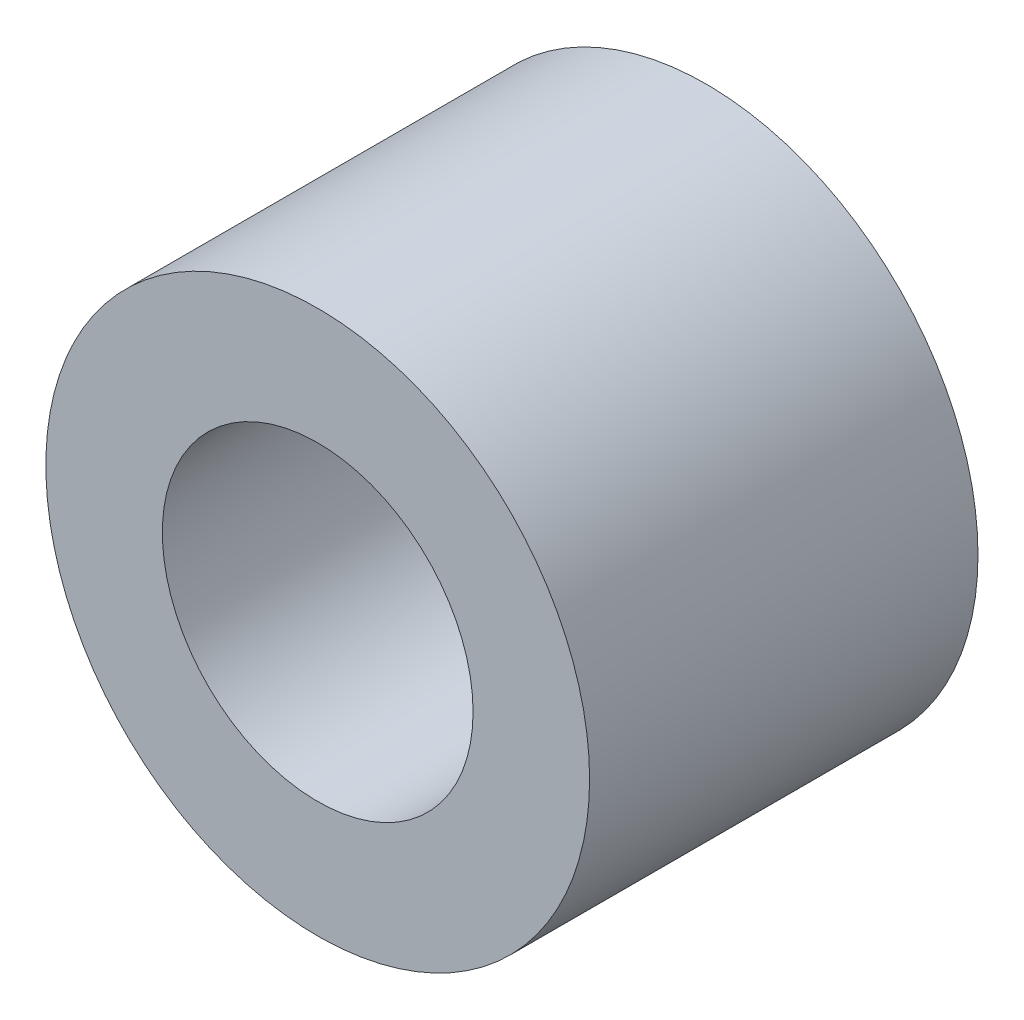
ISO-10303-21;
HEADER;
FILE_DESCRIPTION(('STEP AP214'),'2;1');
FILE_NAME('part.step','',(''),(''),'','','');
FILE_SCHEMA(('AUTOMOTIVE_DESIGN { 1 0 10303 214 1 1 1 1 }'));
ENDSEC;
DATA;
#1=APPLICATION_CONTEXT('core data for automotive mechanical design processes');
#2=APPLICATION_PROTOCOL_DEFINITION('international standard','automotive_design',2000,#1);
#3=PRODUCT_CONTEXT('',#1,'mechanical');
#4=PRODUCT('Part','Part','',(#3));
#5=PRODUCT_RELATED_PRODUCT_CATEGORY('part','',(#4));
#6=PRODUCT_DEFINITION_FORMATION('','',#4);
#7=PRODUCT_DEFINITION_CONTEXT('part definition',#1,'design');
#8=PRODUCT_DEFINITION('design','',#6,#7);
#9=PRODUCT_DEFINITION_SHAPE('','',#8);
#10=(LENGTH_UNIT() NAMED_UNIT(*) SI_UNIT(.MILLI.,.METRE.));
#11=(NAMED_UNIT(*) PLANE_ANGLE_UNIT() SI_UNIT($,.RADIAN.));
#12=(NAMED_UNIT(*) SI_UNIT($,.STERADIAN.) SOLID_ANGLE_UNIT());
#13=UNCERTAINTY_MEASURE_WITH_UNIT(LENGTH_MEASURE(1.E-05),#10,'distance_accuracy_value','');
#14=(GEOMETRIC_REPRESENTATION_CONTEXT(3) GLOBAL_UNCERTAINTY_ASSIGNED_CONTEXT((#13)) GLOBAL_UNIT_ASSIGNED_CONTEXT((#10,
#11,#12)) REPRESENTATION_CONTEXT('',''));
#15=CARTESIAN_POINT('',(0.,0.,0.));
#16=DIRECTION('',(0.,0.,1.));
#17=DIRECTION('',(1.,0.,0.));
#18=AXIS2_PLACEMENT_3D('',#15,#16,#17);
#19=CARTESIAN_POINT('',(0.,0.,10.));
#20=DIRECTION('',(0.,0.,1.));
#21=DIRECTION('',(1.,0.,0.));
#22=AXIS2_PLACEMENT_3D('',#19,#20,#21);
#23=PLANE('',#22);
#24=CARTESIAN_POINT('',(0.,0.,10.));
#25=DIRECTION('',(0.,0.,1.));
#26=DIRECTION('',(1.,0.,0.));
#27=AXIS2_PLACEMENT_3D('',#24,#25,#26);
#28=CIRCLE('',#27,7.);
#29=CARTESIAN_POINT('',(7.,0.,10.));
#30=VERTEX_POINT('',#29);
#31=EDGE_CURVE('E10',#30,#30,#28,.T.);
#32=ORIENTED_EDGE('',*,*,#31,.T.);
#33=EDGE_LOOP('',(#32));
#34=FACE_BOUND('',#33,.T.);
#35=CARTESIAN_POINT('',(0.,0.,10.));
#36=DIRECTION('',(0.,0.,1.));
#37=DIRECTION('',(1.,0.,0.));
#38=AXIS2_PLACEMENT_3D('',#35,#36,#37);
#39=CIRCLE('',#38,4.);
#40=CARTESIAN_POINT('',(4.,0.,10.));
#41=VERTEX_POINT('',#40);
#42=EDGE_CURVE('E42',#41,#41,#39,.T.);
#43=ORIENTED_EDGE('',*,*,#42,.F.);
#44=EDGE_LOOP('',(#43));
#45=FACE_BOUND('',#44,.T.);
#46=ADVANCED_FACE('F31',(#34,#45),#23,.T.);
#47=CARTESIAN_POINT('',(0.,0.,0.));
#48=DIRECTION('',(0.,0.,1.));
#49=DIRECTION('',(1.,0.,0.));
#50=AXIS2_PLACEMENT_3D('',#47,#48,#49);
#51=PLANE('',#50);
#52=CARTESIAN_POINT('',(0.,0.,0.));
#53=DIRECTION('',(0.,0.,1.));
#54=DIRECTION('',(1.,0.,0.));
#55=AXIS2_PLACEMENT_3D('',#52,#53,#54);
#56=CIRCLE('',#55,7.);
#57=CARTESIAN_POINT('',(7.,0.,0.));
#58=VERTEX_POINT('',#57);
#59=EDGE_CURVE('E35',#58,#58,#56,.T.);
#60=ORIENTED_EDGE('',*,*,#59,.F.);
#61=EDGE_LOOP('',(#60));
#62=FACE_BOUND('',#61,.T.);
#63=CARTESIAN_POINT('',(0.,0.,0.));
#64=DIRECTION('',(0.,0.,1.));
#65=DIRECTION('',(1.,0.,0.));
#66=AXIS2_PLACEMENT_3D('',#63,#64,#65);
#67=CIRCLE('',#66,4.);
#68=CARTESIAN_POINT('',(4.,0.,0.));
#69=VERTEX_POINT('',#68);
#70=EDGE_CURVE('E44',#69,#69,#67,.T.);
#71=ORIENTED_EDGE('',*,*,#70,.T.);
#72=EDGE_LOOP('',(#71));
#73=FACE_BOUND('',#72,.T.);
#74=ADVANCED_FACE('F54',(#62,#73),#51,.F.);
#75=CARTESIAN_POINT('',(0.,0.,10.));
#76=DIRECTION('',(0.,0.,-1.));
#77=DIRECTION('',(-1.,0.,0.));
#78=AXIS2_PLACEMENT_3D('',#75,#76,#77);
#79=CYLINDRICAL_SURFACE('',#78,7.);
#80=ORIENTED_EDGE('',*,*,#31,.F.);
#81=EDGE_LOOP('',(#80));
#82=FACE_BOUND('',#81,.T.);
#83=ORIENTED_EDGE('',*,*,#59,.T.);
#84=EDGE_LOOP('',(#83));
#85=FACE_BOUND('',#84,.T.);
#86=ADVANCED_FACE('F33',(#82,#85),#79,.T.);
#87=CARTESIAN_POINT('',(0.,0.,10.));
#88=DIRECTION('',(0.,0.,-1.));
#89=DIRECTION('',(-1.,0.,0.));
#90=AXIS2_PLACEMENT_3D('',#87,#88,#89);
#91=CYLINDRICAL_SURFACE('',#90,4.);
#92=ORIENTED_EDGE('',*,*,#42,.T.);
#93=EDGE_LOOP('',(#92));
#94=FACE_BOUND('',#93,.T.);
#95=ORIENTED_EDGE('',*,*,#70,.F.);
#96=EDGE_LOOP('',(#95));
#97=FACE_BOUND('',#96,.T.);
#98=ADVANCED_FACE('F50',(#94,#97),#91,.F.);
#99=CLOSED_SHELL('',(#46,#74,#86,#98));
#100=MANIFOLD_SOLID_BREP('B2',#99);
#101=ADVANCED_BREP_SHAPE_REPRESENTATION('',(#18,#100),#14);
#102=SHAPE_DEFINITION_REPRESENTATION(#9,#101);
ENDSEC;
END-ISO-10303-21;
